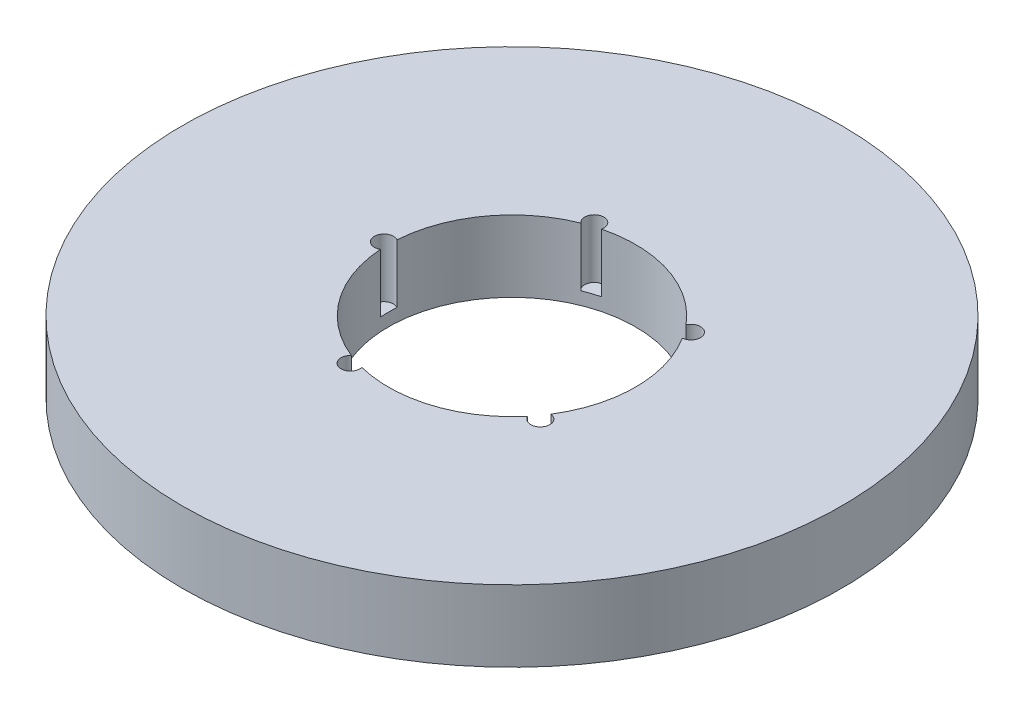
ISO-10303-21;
HEADER;
FILE_DESCRIPTION(('STEP AP214'),'2;1');
FILE_NAME('part.step','',(''),(''),'','','');
FILE_SCHEMA(('AUTOMOTIVE_DESIGN { 1 0 10303 214 1 1 1 1 }'));
ENDSEC;
DATA;
#1=APPLICATION_CONTEXT('core data for automotive mechanical design processes');
#2=APPLICATION_PROTOCOL_DEFINITION('international standard','automotive_design',2000,#1);
#3=PRODUCT_CONTEXT('',#1,'mechanical');
#4=PRODUCT('Part','Part','',(#3));
#5=PRODUCT_RELATED_PRODUCT_CATEGORY('part','',(#4));
#6=PRODUCT_DEFINITION_FORMATION('','',#4);
#7=PRODUCT_DEFINITION_CONTEXT('part definition',#1,'design');
#8=PRODUCT_DEFINITION('design','',#6,#7);
#9=PRODUCT_DEFINITION_SHAPE('','',#8);
#10=(LENGTH_UNIT() NAMED_UNIT(*) SI_UNIT(.MILLI.,.METRE.));
#11=(NAMED_UNIT(*) PLANE_ANGLE_UNIT() SI_UNIT($,.RADIAN.));
#12=(NAMED_UNIT(*) SI_UNIT($,.STERADIAN.) SOLID_ANGLE_UNIT());
#13=UNCERTAINTY_MEASURE_WITH_UNIT(LENGTH_MEASURE(1.E-05),#10,'distance_accuracy_value','');
#14=(GEOMETRIC_REPRESENTATION_CONTEXT(3) GLOBAL_UNCERTAINTY_ASSIGNED_CONTEXT((#13)) GLOBAL_UNIT_ASSIGNED_CONTEXT((#10,
#11,#12)) REPRESENTATION_CONTEXT('',''));
#15=CARTESIAN_POINT('',(0.,0.,0.));
#16=DIRECTION('',(0.,0.,1.));
#17=DIRECTION('',(1.,0.,0.));
#18=AXIS2_PLACEMENT_3D('',#15,#16,#17);
#19=CARTESIAN_POINT('',(0.,13.,0.));
#20=DIRECTION('',(0.,-1.,0.));
#21=DIRECTION('',(0.,0.,-1.));
#22=AXIS2_PLACEMENT_3D('',#19,#20,#21);
#23=CYLINDRICAL_SURFACE('',#22,60.);
#24=CARTESIAN_POINT('',(0.,13.,0.));
#25=DIRECTION('',(0.,1.,0.));
#26=DIRECTION('',(0.,0.,1.));
#27=AXIS2_PLACEMENT_3D('',#24,#25,#26);
#28=CIRCLE('',#27,60.);
#29=CARTESIAN_POINT('',(0.,13.,-60.));
#30=VERTEX_POINT('',#29);
#31=EDGE_CURVE('E160',#30,#30,#28,.T.);
#32=CARTESIAN_POINT('',(0.,0.,0.));
#33=DIRECTION('',(0.,1.,0.));
#34=DIRECTION('',(0.,0.,1.));
#35=AXIS2_PLACEMENT_3D('',#32,#33,#34);
#36=CIRCLE('',#35,60.);
#37=CARTESIAN_POINT('',(0.,0.,-60.));
#38=VERTEX_POINT('',#37);
#39=EDGE_CURVE('E153',#38,#38,#36,.T.);
#40=CARTESIAN_POINT('',(0.,13.,-60.));
#41=CARTESIAN_POINT('',(0.,12.8645833333333,-60.));
#42=CARTESIAN_POINT('',(0.,12.7291666666667,-60.));
#43=CARTESIAN_POINT('',(0.,12.4583333333333,-60.));
#44=CARTESIAN_POINT('',(0.,12.3229166666667,-60.));
#45=CARTESIAN_POINT('',(0.,12.0520833333333,-60.));
#46=CARTESIAN_POINT('',(0.,11.9166666666667,-60.));
#47=CARTESIAN_POINT('',(0.,11.6458333333333,-60.));
#48=CARTESIAN_POINT('',(0.,11.5104166666667,-60.));
#49=CARTESIAN_POINT('',(0.,11.2395833333333,-60.));
#50=CARTESIAN_POINT('',(0.,11.1041666666667,-60.));
#51=CARTESIAN_POINT('',(0.,10.8333333333333,-60.));
#52=CARTESIAN_POINT('',(0.,10.6979166666667,-60.));
#53=CARTESIAN_POINT('',(0.,10.4270833333333,-60.));
#54=CARTESIAN_POINT('',(0.,10.2916666666667,-60.));
#55=CARTESIAN_POINT('',(0.,10.0208333333333,-60.));
#56=CARTESIAN_POINT('',(0.,9.88541666666667,-60.));
#57=CARTESIAN_POINT('',(0.,9.61458333333333,-60.));
#58=CARTESIAN_POINT('',(0.,9.47916666666667,-60.));
#59=CARTESIAN_POINT('',(0.,9.20833333333333,-60.));
#60=CARTESIAN_POINT('',(0.,9.07291666666666,-60.));
#61=CARTESIAN_POINT('',(0.,8.80208333333333,-60.));
#62=CARTESIAN_POINT('',(0.,8.66666666666667,-60.));
#63=CARTESIAN_POINT('',(0.,8.39583333333333,-60.));
#64=CARTESIAN_POINT('',(0.,8.26041666666667,-60.));
#65=CARTESIAN_POINT('',(0.,7.98958333333333,-60.));
#66=CARTESIAN_POINT('',(0.,7.85416666666667,-60.));
#67=CARTESIAN_POINT('',(0.,7.58333333333333,-60.));
#68=CARTESIAN_POINT('',(0.,7.44791666666667,-60.));
#69=CARTESIAN_POINT('',(0.,7.17708333333333,-60.));
#70=CARTESIAN_POINT('',(0.,7.04166666666667,-60.));
#71=CARTESIAN_POINT('',(0.,6.77083333333333,-60.));
#72=CARTESIAN_POINT('',(0.,6.63541666666667,-60.));
#73=CARTESIAN_POINT('',(0.,6.36458333333333,-60.));
#74=CARTESIAN_POINT('',(0.,6.22916666666667,-60.));
#75=CARTESIAN_POINT('',(0.,5.95833333333333,-60.));
#76=CARTESIAN_POINT('',(0.,5.82291666666667,-60.));
#77=CARTESIAN_POINT('',(0.,5.55208333333333,-60.));
#78=CARTESIAN_POINT('',(0.,5.41666666666667,-60.));
#79=CARTESIAN_POINT('',(0.,5.14583333333333,-60.));
#80=CARTESIAN_POINT('',(0.,5.01041666666667,-60.));
#81=CARTESIAN_POINT('',(0.,4.73958333333333,-60.));
#82=CARTESIAN_POINT('',(0.,4.60416666666667,-60.));
#83=CARTESIAN_POINT('',(0.,4.33333333333333,-60.));
#84=CARTESIAN_POINT('',(0.,4.19791666666667,-60.));
#85=CARTESIAN_POINT('',(0.,3.92708333333333,-60.));
#86=CARTESIAN_POINT('',(0.,3.79166666666667,-60.));
#87=CARTESIAN_POINT('',(0.,3.52083333333333,-60.));
#88=CARTESIAN_POINT('',(0.,3.38541666666667,-60.));
#89=CARTESIAN_POINT('',(0.,3.11458333333333,-60.));
#90=CARTESIAN_POINT('',(0.,2.97916666666667,-60.));
#91=CARTESIAN_POINT('',(0.,2.70833333333333,-60.));
#92=CARTESIAN_POINT('',(0.,2.57291666666667,-60.));
#93=CARTESIAN_POINT('',(0.,2.30208333333333,-60.));
#94=CARTESIAN_POINT('',(0.,2.16666666666667,-60.));
#95=CARTESIAN_POINT('',(0.,1.89583333333333,-60.));
#96=CARTESIAN_POINT('',(0.,1.76041666666667,-60.));
#97=CARTESIAN_POINT('',(0.,1.48958333333333,-60.));
#98=CARTESIAN_POINT('',(0.,1.35416666666667,-60.));
#99=CARTESIAN_POINT('',(0.,1.08333333333333,-60.));
#100=CARTESIAN_POINT('',(0.,0.947916666666667,-60.));
#101=CARTESIAN_POINT('',(0.,0.677083333333334,-60.));
#102=CARTESIAN_POINT('',(0.,0.541666666666667,-60.));
#103=CARTESIAN_POINT('',(0.,0.270833333333334,-60.));
#104=CARTESIAN_POINT('',(0.,0.135416666666667,-60.));
#105=CARTESIAN_POINT('',(0.,0.,-60.));
#106=B_SPLINE_CURVE_WITH_KNOTS('',3,(#40,#41,#42,#43,#44,#45,#46,#47,#48,#49,#50,#51,#52,#53,
#54,#55,#56,#57,#58,#59,#60,#61,#62,#63,#64,#65,#66,#67,#68,#69,#70,#71,#72,#73,#74,#75,#76,#77,
#78,#79,#80,#81,#82,#83,#84,#85,#86,#87,#88,#89,#90,#91,#92,#93,#94,#95,#96,#97,#98,#99,#100,
#101,#102,#103,#104,#105),.UNSPECIFIED.,.F.,.F.,(4,2,2,2,2,2,2,2,2,2,2,2,2,2,2,2,2,2,2,2,2,2,2,
2,2,2,2,2,2,2,2,2,4),(0.,0.40625,0.812500000000001,1.21875,1.625,2.03125,2.4375,2.84375,3.25,
3.65625,4.0625,4.46875,4.875,5.28125,5.6875,6.09375,6.5,6.90625,7.3125,7.71875,8.125,8.53125,
8.9375,9.34375,9.75,10.15625,10.5625,10.96875,11.375,11.78125,12.1875,12.59375,13.),.UNSPECIFIED.);
#107=EDGE_CURVE('BSEAM39',#30,#38,#106,.T.);
#108=ORIENTED_EDGE('',*,*,#31,.F.);
#109=ORIENTED_EDGE('',*,*,#39,.T.);
#110=ORIENTED_EDGE('',*,*,#107,.T.);
#111=ORIENTED_EDGE('',*,*,#107,.F.);
#112=EDGE_LOOP('',(#108,#110,#109,#111));
#113=FACE_BOUND('',#112,.T.);
#114=ADVANCED_FACE('F39',(#113),#23,.T.);
#115=CARTESIAN_POINT('',(0.,13.,0.));
#116=DIRECTION('',(0.,1.,0.));
#117=DIRECTION('',(0.,0.,1.));
#118=AXIS2_PLACEMENT_3D('',#115,#116,#117);
#119=PLANE('',#118);
#120=CARTESIAN_POINT('',(-7.20899848222606,13.,22.1870159482687));
#121=DIRECTION('',(0.,1.,0.));
#122=DIRECTION('',(0.951056516295155,0.,0.309016994374945));
#123=AXIS2_PLACEMENT_3D('',#120,#121,#122);
#124=CIRCLE('',#123,1.74253919727996);
#125=CARTESIAN_POINT('',(-8.36818277630689,13.,20.885964594012));
#126=VERTEX_POINT('',#125);
#127=CARTESIAN_POINT('',(-5.50645989019485,13.,21.8157947248702));
#128=VERTEX_POINT('',#127);
#129=EDGE_CURVE('E186',#126,#128,#124,.T.);
#130=ORIENTED_EDGE('',*,*,#129,.F.);
#131=CARTESIAN_POINT('',(0.,13.,0.));
#132=DIRECTION('',(0.,1.,0.));
#133=DIRECTION('',(0.,0.,1.));
#134=AXIS2_PLACEMENT_3D('',#131,#132,#133);
#135=CIRCLE('',#134,22.5);
#136=CARTESIAN_POINT('',(-22.4496434161595,13.,1.50449675549246));
#137=VERTEX_POINT('',#136);
#138=EDGE_CURVE('E148',#137,#126,#135,.T.);
#139=ORIENTED_EDGE('',*,*,#138,.F.);
#140=CARTESIAN_POINT('',(-23.3288091381765,13.,0.));
#141=DIRECTION('',(0.,1.,0.));
#142=DIRECTION('',(0.,0.,1.));
#143=AXIS2_PLACEMENT_3D('',#140,#141,#142);
#144=CIRCLE('',#143,1.74253919727996);
#145=CARTESIAN_POINT('',(-22.4496434161595,13.,-1.50449675549246));
#146=VERTEX_POINT('',#145);
#147=EDGE_CURVE('E142',#146,#137,#144,.T.);
#148=ORIENTED_EDGE('',*,*,#147,.F.);
#149=CARTESIAN_POINT('',(-8.36818277630719,13.,-20.8859645940118));
#150=VERTEX_POINT('',#149);
#151=EDGE_CURVE('E132',#150,#146,#135,.T.);
#152=ORIENTED_EDGE('',*,*,#151,.F.);
#153=CARTESIAN_POINT('',(-7.20899848222637,13.,-22.1870159482686));
#154=DIRECTION('',(0.,1.,0.));
#155=DIRECTION('',(-0.95105651629515,0.,0.309016994374958));
#156=AXIS2_PLACEMENT_3D('',#153,#154,#155);
#157=CIRCLE('',#156,1.74253919727996);
#158=CARTESIAN_POINT('',(-5.50645989019516,13.,-21.8157947248701));
#159=VERTEX_POINT('',#158);
#160=EDGE_CURVE('E111',#159,#150,#157,.T.);
#161=ORIENTED_EDGE('',*,*,#160,.F.);
#162=CARTESIAN_POINT('',(17.2778220363302,13.,-14.4127327624189));
#163=VERTEX_POINT('',#162);
#164=EDGE_CURVE('E141',#163,#159,#135,.T.);
#165=ORIENTED_EDGE('',*,*,#164,.F.);
#166=CARTESIAN_POINT('',(18.8734030513143,13.,-13.7123299649662));
#167=DIRECTION('',(0.,1.,0.));
#168=DIRECTION('',(-0.58778525229248,0.,-0.809016994374942));
#169=AXIS2_PLACEMENT_3D('',#166,#167,#168);
#170=CIRCLE('',#169,1.74253919727996);
#171=CARTESIAN_POINT('',(19.0464640463309,13.,-11.9784058760682));
#172=VERTEX_POINT('',#171);
#173=EDGE_CURVE('E173',#172,#163,#170,.T.);
#174=ORIENTED_EDGE('',*,*,#173,.F.);
#175=CARTESIAN_POINT('',(19.0464640463311,13.,11.9784058760679));
#176=VERTEX_POINT('',#175);
#177=EDGE_CURVE('E150',#176,#172,#135,.T.);
#178=ORIENTED_EDGE('',*,*,#177,.F.);
#179=CARTESIAN_POINT('',(18.8734030513145,13.,13.7123299649659));
#180=DIRECTION('',(0.,1.,0.));
#181=DIRECTION('',(0.587785252292469,0.,-0.809016994374951));
#182=AXIS2_PLACEMENT_3D('',#179,#180,#181);
#183=CIRCLE('',#182,1.74253919727996);
#184=CARTESIAN_POINT('',(17.2778220363304,13.,14.4127327624186));
#185=VERTEX_POINT('',#184);
#186=EDGE_CURVE('E172',#185,#176,#183,.T.);
#187=ORIENTED_EDGE('',*,*,#186,.F.);
#188=EDGE_CURVE('E152',#128,#185,#135,.T.);
#189=ORIENTED_EDGE('',*,*,#188,.F.);
#190=EDGE_LOOP('',(#130,#139,#148,#152,#161,#165,#174,#178,#187,#189));
#191=FACE_BOUND('',#190,.T.);
#192=ORIENTED_EDGE('',*,*,#31,.T.);
#193=EDGE_LOOP('',(#192));
#194=FACE_BOUND('',#193,.T.);
#195=ADVANCED_FACE('F138',(#191,#194),#119,.T.);
#196=CARTESIAN_POINT('',(0.,0.,0.));
#197=DIRECTION('',(0.,1.,0.));
#198=DIRECTION('',(0.,0.,1.));
#199=AXIS2_PLACEMENT_3D('',#196,#197,#198);
#200=PLANE('',#199);
#201=CARTESIAN_POINT('',(0.,0.,0.));
#202=DIRECTION('',(0.,1.,0.));
#203=DIRECTION('',(0.,0.,1.));
#204=AXIS2_PLACEMENT_3D('',#201,#202,#203);
#205=CIRCLE('',#204,22.5);
#206=CARTESIAN_POINT('',(0.,0.,22.5));
#207=VERTEX_POINT('',#206);
#208=EDGE_CURVE('E145',#207,#207,#205,.T.);
#209=ORIENTED_EDGE('',*,*,#208,.T.);
#210=EDGE_LOOP('',(#209));
#211=FACE_BOUND('',#210,.T.);
#212=ORIENTED_EDGE('',*,*,#39,.F.);
#213=EDGE_LOOP('',(#212));
#214=FACE_BOUND('',#213,.T.);
#215=ADVANCED_FACE('F216',(#211,#214),#200,.F.);
#216=CARTESIAN_POINT('',(0.,13.,0.));
#217=DIRECTION('',(0.,-1.,0.));
#218=DIRECTION('',(0.,0.,-1.));
#219=AXIS2_PLACEMENT_3D('',#216,#217,#218);
#220=CYLINDRICAL_SURFACE('',#219,22.5);
#221=DIRECTION('',(0.,1.,0.));
#222=VECTOR('',#221,1.);
#223=CARTESIAN_POINT('',(-8.36818277630688,7.66225969153024,20.8859645940119));
#224=LINE('',#223,#222);
#225=CARTESIAN_POINT('',(-8.36818277630689,2.32451938306047,20.885964594012));
#226=VERTEX_POINT('',#225);
#227=EDGE_CURVE('E11',#226,#126,#224,.T.);
#228=ORIENTED_EDGE('',*,*,#227,.F.);
#229=CARTESIAN_POINT('',(0.,2.32451938306047,0.));
#230=DIRECTION('',(0.,1.,0.));
#231=DIRECTION('',(0.,0.,1.));
#232=AXIS2_PLACEMENT_3D('',#229,#230,#231);
#233=CIRCLE('',#232,22.5);
#234=CARTESIAN_POINT('',(-5.50645989019485,2.32451938306047,21.8157947248702));
#235=VERTEX_POINT('',#234);
#236=EDGE_CURVE('E192',#226,#235,#233,.T.);
#237=ORIENTED_EDGE('',*,*,#236,.T.);
#238=DIRECTION('',(0.,1.,0.));
#239=VECTOR('',#238,1.);
#240=CARTESIAN_POINT('',(-5.50645989019485,7.66225969153024,21.8157947248702));
#241=LINE('',#240,#239);
#242=EDGE_CURVE('E46',#128,#235,#241,.F.);
#243=ORIENTED_EDGE('',*,*,#242,.F.);
#244=ORIENTED_EDGE('',*,*,#188,.T.);
#245=DIRECTION('',(0.,1.,0.));
#246=VECTOR('',#245,1.);
#247=CARTESIAN_POINT('',(17.2778220363304,7.66225969153024,14.4127327624186));
#248=LINE('',#247,#246);
#249=CARTESIAN_POINT('',(17.2778220363304,2.32451938306047,14.4127327624186));
#250=VERTEX_POINT('',#249);
#251=EDGE_CURVE('E195',#250,#185,#248,.T.);
#252=ORIENTED_EDGE('',*,*,#251,.F.);
#253=CARTESIAN_POINT('',(0.,2.32451938306047,0.));
#254=DIRECTION('',(0.,1.,0.));
#255=DIRECTION('',(0.,0.,1.));
#256=AXIS2_PLACEMENT_3D('',#253,#254,#255);
#257=CIRCLE('',#256,22.5);
#258=CARTESIAN_POINT('',(19.0464640463311,2.32451938306047,11.9784058760679));
#259=VERTEX_POINT('',#258);
#260=EDGE_CURVE('E197',#250,#259,#257,.T.);
#261=ORIENTED_EDGE('',*,*,#260,.T.);
#262=DIRECTION('',(0.,1.,0.));
#263=VECTOR('',#262,1.);
#264=CARTESIAN_POINT('',(19.0464640463311,7.66225969153024,11.9784058760679));
#265=LINE('',#264,#263);
#266=EDGE_CURVE('E168',#176,#259,#265,.F.);
#267=ORIENTED_EDGE('',*,*,#266,.F.);
#268=ORIENTED_EDGE('',*,*,#177,.T.);
#269=DIRECTION('',(0.,1.,0.));
#270=VECTOR('',#269,1.);
#271=CARTESIAN_POINT('',(19.0464640463309,7.66225969153024,-11.9784058760682));
#272=LINE('',#271,#270);
#273=CARTESIAN_POINT('',(19.0464640463309,2.32451938306047,-11.9784058760682));
#274=VERTEX_POINT('',#273);
#275=EDGE_CURVE('E169',#274,#172,#272,.T.);
#276=ORIENTED_EDGE('',*,*,#275,.F.);
#277=CARTESIAN_POINT('',(0.,2.32451938306047,0.));
#278=DIRECTION('',(0.,1.,0.));
#279=DIRECTION('',(0.,0.,1.));
#280=AXIS2_PLACEMENT_3D('',#277,#278,#279);
#281=CIRCLE('',#280,22.5);
#282=CARTESIAN_POINT('',(17.2778220363302,2.32451938306047,-14.4127327624189));
#283=VERTEX_POINT('',#282);
#284=EDGE_CURVE('E332',#274,#283,#281,.T.);
#285=ORIENTED_EDGE('',*,*,#284,.T.);
#286=DIRECTION('',(0.,1.,0.));
#287=VECTOR('',#286,1.);
#288=CARTESIAN_POINT('',(17.2778220363302,7.66225969153024,-14.4127327624189));
#289=LINE('',#288,#287);
#290=EDGE_CURVE('E335',#163,#283,#289,.F.);
#291=ORIENTED_EDGE('',*,*,#290,.F.);
#292=ORIENTED_EDGE('',*,*,#164,.T.);
#293=DIRECTION('',(0.,1.,0.));
#294=VECTOR('',#293,1.);
#295=CARTESIAN_POINT('',(-5.50645989019515,7.66225969153024,-21.8157947248702));
#296=LINE('',#295,#294);
#297=CARTESIAN_POINT('',(-5.50645989019516,2.32451938306047,-21.8157947248701));
#298=VERTEX_POINT('',#297);
#299=EDGE_CURVE('E121',#298,#159,#296,.T.);
#300=ORIENTED_EDGE('',*,*,#299,.F.);
#301=CARTESIAN_POINT('',(0.,2.32451938306047,0.));
#302=DIRECTION('',(0.,1.,0.));
#303=DIRECTION('',(0.,0.,1.));
#304=AXIS2_PLACEMENT_3D('',#301,#302,#303);
#305=CIRCLE('',#304,22.5);
#306=CARTESIAN_POINT('',(-8.36818277630719,2.32451938306047,-20.8859645940118));
#307=VERTEX_POINT('',#306);
#308=EDGE_CURVE('E134',#298,#307,#305,.T.);
#309=ORIENTED_EDGE('',*,*,#308,.T.);
#310=DIRECTION('',(0.,1.,0.));
#311=VECTOR('',#310,1.);
#312=CARTESIAN_POINT('',(-8.36818277630719,7.66225969153024,-20.8859645940118));
#313=LINE('',#312,#311);
#314=EDGE_CURVE('E117',#150,#307,#313,.F.);
#315=ORIENTED_EDGE('',*,*,#314,.F.);
#316=ORIENTED_EDGE('',*,*,#151,.T.);
#317=DIRECTION('',(0.,1.,0.));
#318=VECTOR('',#317,1.);
#319=CARTESIAN_POINT('',(-22.4496434161595,7.66225969153024,-1.50449675549246));
#320=LINE('',#319,#318);
#321=CARTESIAN_POINT('',(-22.4496434161595,2.32451938306047,-1.50449675549246));
#322=VERTEX_POINT('',#321);
#323=EDGE_CURVE('E338',#322,#146,#320,.T.);
#324=ORIENTED_EDGE('',*,*,#323,.F.);
#325=CARTESIAN_POINT('',(0.,2.32451938306047,0.));
#326=DIRECTION('',(0.,1.,0.));
#327=DIRECTION('',(0.,0.,1.));
#328=AXIS2_PLACEMENT_3D('',#325,#326,#327);
#329=CIRCLE('',#328,22.5);
#330=CARTESIAN_POINT('',(-22.4496434161595,2.32451938306047,1.50449675549246));
#331=VERTEX_POINT('',#330);
#332=EDGE_CURVE('E342',#322,#331,#329,.T.);
#333=ORIENTED_EDGE('',*,*,#332,.T.);
#334=DIRECTION('',(0.,1.,0.));
#335=VECTOR('',#334,1.);
#336=CARTESIAN_POINT('',(-22.4496434161595,7.66225969153024,1.50449675549246));
#337=LINE('',#336,#335);
#338=EDGE_CURVE('E341',#137,#331,#337,.F.);
#339=ORIENTED_EDGE('',*,*,#338,.F.);
#340=ORIENTED_EDGE('',*,*,#138,.T.);
#341=EDGE_LOOP('',(#228,#237,#243,#244,#252,#261,#267,#268,#276,#285,#291,#292,#300,#309,#315,
#316,#324,#333,#339,#340));
#342=FACE_BOUND('',#341,.T.);
#343=ORIENTED_EDGE('',*,*,#208,.F.);
#344=EDGE_LOOP('',(#343));
#345=FACE_BOUND('',#344,.T.);
#346=ADVANCED_FACE('F128',(#342,#345),#220,.F.);
#347=CARTESIAN_POINT('',(-23.3288091381765,2.32451938306047,0.));
#348=DIRECTION('',(0.,1.,0.));
#349=DIRECTION('',(0.,0.,1.));
#350=AXIS2_PLACEMENT_3D('',#347,#348,#349);
#351=CYLINDRICAL_SURFACE('',#350,1.74253919727996);
#352=ORIENTED_EDGE('',*,*,#323,.T.);
#353=ORIENTED_EDGE('',*,*,#147,.T.);
#354=ORIENTED_EDGE('',*,*,#338,.T.);
#355=CARTESIAN_POINT('',(-23.3288091381765,2.32451938306047,0.));
#356=DIRECTION('',(0.,1.,0.));
#357=DIRECTION('',(0.,0.,1.));
#358=AXIS2_PLACEMENT_3D('',#355,#356,#357);
#359=CIRCLE('',#358,1.74253919727996);
#360=EDGE_CURVE('E149',#322,#331,#359,.T.);
#361=ORIENTED_EDGE('',*,*,#360,.F.);
#362=EDGE_LOOP('',(#352,#353,#354,#361));
#363=FACE_BOUND('',#362,.T.);
#364=ADVANCED_FACE('F227',(#363),#351,.F.);
#365=CARTESIAN_POINT('',(-23.3288091381765,2.32451938306047,0.));
#366=DIRECTION('',(0.,1.,0.));
#367=DIRECTION('',(0.,0.,1.));
#368=AXIS2_PLACEMENT_3D('',#365,#366,#367);
#369=PLANE('',#368);
#370=ORIENTED_EDGE('',*,*,#360,.T.);
#371=ORIENTED_EDGE('',*,*,#332,.F.);
#372=EDGE_LOOP('',(#370,#371));
#373=FACE_BOUND('',#372,.T.);
#374=ADVANCED_FACE('F235',(#373),#369,.T.);
#375=CARTESIAN_POINT('',(-7.20899848222637,2.32451938306047,-22.1870159482686));
#376=DIRECTION('',(0.,1.,0.));
#377=DIRECTION('',(0.,0.,1.));
#378=AXIS2_PLACEMENT_3D('',#375,#376,#377);
#379=CYLINDRICAL_SURFACE('',#378,1.74253919727996);
#380=ORIENTED_EDGE('',*,*,#299,.T.);
#381=ORIENTED_EDGE('',*,*,#160,.T.);
#382=ORIENTED_EDGE('',*,*,#314,.T.);
#383=CARTESIAN_POINT('',(-7.20899848222637,2.32451938306047,-22.1870159482686));
#384=DIRECTION('',(0.,1.,0.));
#385=DIRECTION('',(-0.95105651629515,0.,0.309016994374958));
#386=AXIS2_PLACEMENT_3D('',#383,#384,#385);
#387=CIRCLE('',#386,1.74253919727996);
#388=EDGE_CURVE('E127',#298,#307,#387,.T.);
#389=ORIENTED_EDGE('',*,*,#388,.F.);
#390=EDGE_LOOP('',(#380,#381,#382,#389));
#391=FACE_BOUND('',#390,.T.);
#392=ADVANCED_FACE('F116',(#391),#379,.F.);
#393=CARTESIAN_POINT('',(-7.20899848222637,2.32451938306047,-22.1870159482686));
#394=DIRECTION('',(0.,1.,0.));
#395=DIRECTION('',(-0.95105651629515,0.,0.309016994374958));
#396=AXIS2_PLACEMENT_3D('',#393,#394,#395);
#397=PLANE('',#396);
#398=ORIENTED_EDGE('',*,*,#388,.T.);
#399=ORIENTED_EDGE('',*,*,#308,.F.);
#400=EDGE_LOOP('',(#398,#399));
#401=FACE_BOUND('',#400,.T.);
#402=ADVANCED_FACE('F236',(#401),#397,.T.);
#403=CARTESIAN_POINT('',(18.8734030513143,2.32451938306047,-13.7123299649662));
#404=DIRECTION('',(0.,1.,0.));
#405=DIRECTION('',(0.,0.,1.));
#406=AXIS2_PLACEMENT_3D('',#403,#404,#405);
#407=CYLINDRICAL_SURFACE('',#406,1.74253919727996);
#408=ORIENTED_EDGE('',*,*,#275,.T.);
#409=ORIENTED_EDGE('',*,*,#173,.T.);
#410=ORIENTED_EDGE('',*,*,#290,.T.);
#411=CARTESIAN_POINT('',(18.8734030513143,2.32451938306047,-13.7123299649662));
#412=DIRECTION('',(0.,1.,0.));
#413=DIRECTION('',(-0.58778525229248,0.,-0.809016994374942));
#414=AXIS2_PLACEMENT_3D('',#411,#412,#413);
#415=CIRCLE('',#414,1.74253919727996);
#416=EDGE_CURVE('E177',#274,#283,#415,.T.);
#417=ORIENTED_EDGE('',*,*,#416,.F.);
#418=EDGE_LOOP('',(#408,#409,#410,#417));
#419=FACE_BOUND('',#418,.T.);
#420=ADVANCED_FACE('F241',(#419),#407,.F.);
#421=CARTESIAN_POINT('',(18.8734030513143,2.32451938306047,-13.7123299649662));
#422=DIRECTION('',(0.,1.,0.));
#423=DIRECTION('',(-0.58778525229248,0.,-0.809016994374942));
#424=AXIS2_PLACEMENT_3D('',#421,#422,#423);
#425=PLANE('',#424);
#426=ORIENTED_EDGE('',*,*,#416,.T.);
#427=ORIENTED_EDGE('',*,*,#284,.F.);
#428=EDGE_LOOP('',(#426,#427));
#429=FACE_BOUND('',#428,.T.);
#430=ADVANCED_FACE('F244',(#429),#425,.T.);
#431=CARTESIAN_POINT('',(18.8734030513145,2.32451938306047,13.7123299649659));
#432=DIRECTION('',(0.,1.,0.));
#433=DIRECTION('',(0.,0.,1.));
#434=AXIS2_PLACEMENT_3D('',#431,#432,#433);
#435=CYLINDRICAL_SURFACE('',#434,1.74253919727996);
#436=ORIENTED_EDGE('',*,*,#251,.T.);
#437=ORIENTED_EDGE('',*,*,#186,.T.);
#438=ORIENTED_EDGE('',*,*,#266,.T.);
#439=CARTESIAN_POINT('',(18.8734030513145,2.32451938306047,13.7123299649659));
#440=DIRECTION('',(0.,1.,0.));
#441=DIRECTION('',(0.587785252292469,0.,-0.809016994374951));
#442=AXIS2_PLACEMENT_3D('',#439,#440,#441);
#443=CIRCLE('',#442,1.74253919727996);
#444=EDGE_CURVE('E56',#250,#259,#443,.T.);
#445=ORIENTED_EDGE('',*,*,#444,.F.);
#446=EDGE_LOOP('',(#436,#437,#438,#445));
#447=FACE_BOUND('',#446,.T.);
#448=ADVANCED_FACE('F191',(#447),#435,.F.);
#449=CARTESIAN_POINT('',(18.8734030513145,2.32451938306047,13.7123299649659));
#450=DIRECTION('',(0.,1.,0.));
#451=DIRECTION('',(0.587785252292469,0.,-0.809016994374951));
#452=AXIS2_PLACEMENT_3D('',#449,#450,#451);
#453=PLANE('',#452);
#454=ORIENTED_EDGE('',*,*,#444,.T.);
#455=ORIENTED_EDGE('',*,*,#260,.F.);
#456=EDGE_LOOP('',(#454,#455));
#457=FACE_BOUND('',#456,.T.);
#458=ADVANCED_FACE('F208',(#457),#453,.T.);
#459=CARTESIAN_POINT('',(-7.20899848222606,2.32451938306047,22.1870159482687));
#460=DIRECTION('',(0.,1.,0.));
#461=DIRECTION('',(0.,0.,1.));
#462=AXIS2_PLACEMENT_3D('',#459,#460,#461);
#463=CYLINDRICAL_SURFACE('',#462,1.74253919727996);
#464=ORIENTED_EDGE('',*,*,#227,.T.);
#465=ORIENTED_EDGE('',*,*,#129,.T.);
#466=ORIENTED_EDGE('',*,*,#242,.T.);
#467=CARTESIAN_POINT('',(-7.20899848222606,2.32451938306047,22.1870159482687));
#468=DIRECTION('',(0.,1.,0.));
#469=DIRECTION('',(0.951056516295155,0.,0.309016994374945));
#470=AXIS2_PLACEMENT_3D('',#467,#468,#469);
#471=CIRCLE('',#470,1.74253919727996);
#472=EDGE_CURVE('E55',#226,#235,#471,.T.);
#473=ORIENTED_EDGE('',*,*,#472,.F.);
#474=EDGE_LOOP('',(#464,#465,#466,#473));
#475=FACE_BOUND('',#474,.T.);
#476=ADVANCED_FACE('F203',(#475),#463,.F.);
#477=CARTESIAN_POINT('',(-7.20899848222606,2.32451938306047,22.1870159482687));
#478=DIRECTION('',(0.,1.,0.));
#479=DIRECTION('',(0.951056516295155,0.,0.309016994374945));
#480=AXIS2_PLACEMENT_3D('',#477,#478,#479);
#481=PLANE('',#480);
#482=ORIENTED_EDGE('',*,*,#472,.T.);
#483=ORIENTED_EDGE('',*,*,#236,.F.);
#484=EDGE_LOOP('',(#482,#483));
#485=FACE_BOUND('',#484,.T.);
#486=ADVANCED_FACE('F205',(#485),#481,.T.);
#487=CLOSED_SHELL('',(#114,#195,#215,#346,#364,#374,#392,#402,#420,#430,#448,#458,#476,#486));
#488=MANIFOLD_SOLID_BREP('B2',#487);
#489=ADVANCED_BREP_SHAPE_REPRESENTATION('',(#18,#488),#14);
#490=SHAPE_DEFINITION_REPRESENTATION(#9,#489);
ENDSEC;
END-ISO-10303-21;
